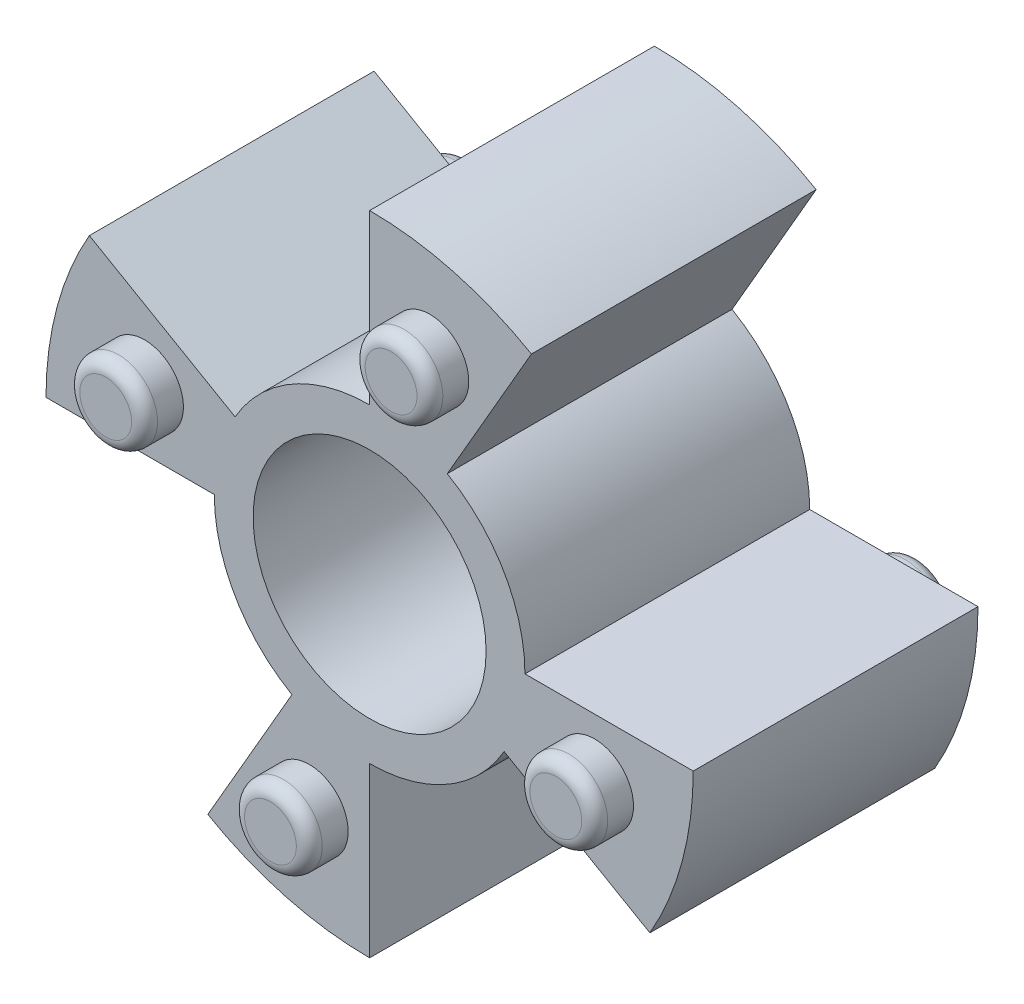
ISO-10303-21;
HEADER;
FILE_DESCRIPTION(('STEP AP214'),'2;1');
FILE_NAME('part.step','',(''),(''),'','','');
FILE_SCHEMA(('AUTOMOTIVE_DESIGN { 1 0 10303 214 1 1 1 1 }'));
ENDSEC;
DATA;
#1=APPLICATION_CONTEXT('core data for automotive mechanical design processes');
#2=APPLICATION_PROTOCOL_DEFINITION('international standard','automotive_design',2000,#1);
#3=PRODUCT_CONTEXT('',#1,'mechanical');
#4=PRODUCT('Part','Part','',(#3));
#5=PRODUCT_RELATED_PRODUCT_CATEGORY('part','',(#4));
#6=PRODUCT_DEFINITION_FORMATION('','',#4);
#7=PRODUCT_DEFINITION_CONTEXT('part definition',#1,'design');
#8=PRODUCT_DEFINITION('design','',#6,#7);
#9=PRODUCT_DEFINITION_SHAPE('','',#8);
#10=(LENGTH_UNIT() NAMED_UNIT(*) SI_UNIT(.MILLI.,.METRE.));
#11=(NAMED_UNIT(*) PLANE_ANGLE_UNIT() SI_UNIT($,.RADIAN.));
#12=(NAMED_UNIT(*) SI_UNIT($,.STERADIAN.) SOLID_ANGLE_UNIT());
#13=UNCERTAINTY_MEASURE_WITH_UNIT(LENGTH_MEASURE(1.E-05),#10,'distance_accuracy_value','');
#14=(GEOMETRIC_REPRESENTATION_CONTEXT(3) GLOBAL_UNCERTAINTY_ASSIGNED_CONTEXT((#13)) GLOBAL_UNIT_ASSIGNED_CONTEXT((#10,
#11,#12)) REPRESENTATION_CONTEXT('',''));
#15=CARTESIAN_POINT('',(0.,0.,0.));
#16=DIRECTION('',(0.,0.,1.));
#17=DIRECTION('',(1.,0.,0.));
#18=AXIS2_PLACEMENT_3D('',#15,#16,#17);
#19=CARTESIAN_POINT('',(0.,0.,5.5));
#20=DIRECTION('',(0.,0.,1.));
#21=DIRECTION('',(1.,0.,0.));
#22=AXIS2_PLACEMENT_3D('',#19,#20,#21);
#23=PLANE('',#22);
#24=CARTESIAN_POINT('',(-8.69333243660161,2.32937140592269,5.5));
#25=DIRECTION('',(0.,0.,1.));
#26=DIRECTION('',(-1.,0.,0.));
#27=AXIS2_PLACEMENT_3D('',#24,#25,#26);
#28=CIRCLE('',#27,1.5);
#29=CARTESIAN_POINT('',(-10.1933324366016,2.32937140592269,5.5));
#30=VERTEX_POINT('',#29);
#31=EDGE_CURVE('E293',#30,#30,#28,.T.);
#32=ORIENTED_EDGE('',*,*,#31,.F.);
#33=EDGE_LOOP('',(#32));
#34=FACE_BOUND('',#33,.T.);
#35=CARTESIAN_POINT('',(8.69333243660161,-2.32937140592269,5.5));
#36=DIRECTION('',(0.,0.,1.));
#37=DIRECTION('',(1.,0.,0.));
#38=AXIS2_PLACEMENT_3D('',#35,#36,#37);
#39=CIRCLE('',#38,1.5);
#40=CARTESIAN_POINT('',(10.1933324366016,-2.32937140592269,5.5));
#41=VERTEX_POINT('',#40);
#42=EDGE_CURVE('E304',#41,#41,#39,.T.);
#43=ORIENTED_EDGE('',*,*,#42,.F.);
#44=EDGE_LOOP('',(#43));
#45=FACE_BOUND('',#44,.T.);
#46=DIRECTION('',(-1.,0.,0.));
#47=VECTOR('',#46,1.);
#48=CARTESIAN_POINT('',(-12.5,1.30930550206618E-13,5.5));
#49=LINE('',#48,#47);
#50=CARTESIAN_POINT('',(-6.,0.,5.5));
#51=VERTEX_POINT('',#50);
#52=CARTESIAN_POINT('',(-12.5,1.30930550206618E-13,5.5));
#53=VERTEX_POINT('',#52);
#54=EDGE_CURVE('E156',#51,#53,#49,.T.);
#55=ORIENTED_EDGE('',*,*,#54,.F.);
#56=CARTESIAN_POINT('',(0.,0.,5.5));
#57=DIRECTION('',(0.,0.,-1.));
#58=DIRECTION('',(0.,-1.,0.));
#59=AXIS2_PLACEMENT_3D('',#56,#57,#58);
#60=CIRCLE('',#59,6.);
#61=CARTESIAN_POINT('',(-3.00000000000004,-5.19615242270661,5.5));
#62=VERTEX_POINT('',#61);
#63=EDGE_CURVE('E312',#62,#51,#60,.T.);
#64=ORIENTED_EDGE('',*,*,#63,.F.);
#65=DIRECTION('',(0.500000000000007,0.866025403784435,0.));
#66=VECTOR('',#65,1.);
#67=CARTESIAN_POINT('',(-6.25000000000008,-10.8253175473054,5.5));
#68=LINE('',#67,#66);
#69=CARTESIAN_POINT('',(-6.25000000000008,-10.8253175473054,5.5));
#70=VERTEX_POINT('',#69);
#71=EDGE_CURVE('E306',#70,#62,#68,.T.);
#72=ORIENTED_EDGE('',*,*,#71,.F.);
#73=CARTESIAN_POINT('',(0.,0.,5.5));
#74=DIRECTION('',(0.,0.,1.));
#75=DIRECTION('',(1.,0.,0.));
#76=AXIS2_PLACEMENT_3D('',#73,#74,#75);
#77=CIRCLE('',#76,12.5);
#78=CARTESIAN_POINT('',(0.,-12.5,5.5));
#79=VERTEX_POINT('',#78);
#80=EDGE_CURVE('E164',#70,#79,#77,.T.);
#81=ORIENTED_EDGE('',*,*,#80,.T.);
#82=DIRECTION('',(0.,-1.,0.));
#83=VECTOR('',#82,1.);
#84=CARTESIAN_POINT('',(0.,-12.5,5.5));
#85=LINE('',#84,#83);
#86=CARTESIAN_POINT('',(0.,-6.,5.5));
#87=VERTEX_POINT('',#86);
#88=EDGE_CURVE('E326',#87,#79,#85,.T.);
#89=ORIENTED_EDGE('',*,*,#88,.F.);
#90=CARTESIAN_POINT('',(0.,0.,5.5));
#91=DIRECTION('',(0.,0.,-1.));
#92=DIRECTION('',(1.,0.,0.));
#93=AXIS2_PLACEMENT_3D('',#90,#91,#92);
#94=CIRCLE('',#93,6.);
#95=CARTESIAN_POINT('',(5.19615242270664,-2.99999999999998,5.5));
#96=VERTEX_POINT('',#95);
#97=EDGE_CURVE('E332',#96,#87,#94,.T.);
#98=ORIENTED_EDGE('',*,*,#97,.F.);
#99=DIRECTION('',(-0.86602540378444,0.499999999999998,0.));
#100=VECTOR('',#99,1.);
#101=CARTESIAN_POINT('',(10.8253175473055,-6.24999999999997,5.5));
#102=LINE('',#101,#100);
#103=CARTESIAN_POINT('',(10.8253175473055,-6.24999999999997,5.5));
#104=VERTEX_POINT('',#103);
#105=EDGE_CURVE('E319',#104,#96,#102,.T.);
#106=ORIENTED_EDGE('',*,*,#105,.F.);
#107=CARTESIAN_POINT('',(12.5,0.,5.5));
#108=VERTEX_POINT('',#107);
#109=EDGE_CURVE('E405',#104,#108,#77,.T.);
#110=ORIENTED_EDGE('',*,*,#109,.T.);
#111=DIRECTION('',(1.,0.,0.));
#112=VECTOR('',#111,1.);
#113=CARTESIAN_POINT('',(12.5,0.,5.5));
#114=LINE('',#113,#112);
#115=CARTESIAN_POINT('',(6.,0.,5.5));
#116=VERTEX_POINT('',#115);
#117=EDGE_CURVE('E349',#116,#108,#114,.T.);
#118=ORIENTED_EDGE('',*,*,#117,.F.);
#119=CARTESIAN_POINT('',(0.,0.,5.5));
#120=DIRECTION('',(0.,0.,-1.));
#121=DIRECTION('',(0.,1.,0.));
#122=AXIS2_PLACEMENT_3D('',#119,#120,#121);
#123=CIRCLE('',#122,6.);
#124=CARTESIAN_POINT('',(3.,5.19615242270663,5.5));
#125=VERTEX_POINT('',#124);
#126=EDGE_CURVE('E358',#125,#116,#123,.T.);
#127=ORIENTED_EDGE('',*,*,#126,.F.);
#128=DIRECTION('',(-0.500000000000001,-0.866025403784438,0.));
#129=VECTOR('',#128,1.);
#130=CARTESIAN_POINT('',(6.25000000000001,10.8253175473055,5.5));
#131=LINE('',#130,#129);
#132=CARTESIAN_POINT('',(6.25000000000001,10.8253175473055,5.5));
#133=VERTEX_POINT('',#132);
#134=EDGE_CURVE('E339',#133,#125,#131,.T.);
#135=ORIENTED_EDGE('',*,*,#134,.F.);
#136=CARTESIAN_POINT('',(0.,12.5,5.5));
#137=VERTEX_POINT('',#136);
#138=EDGE_CURVE('E399',#133,#137,#77,.T.);
#139=ORIENTED_EDGE('',*,*,#138,.T.);
#140=DIRECTION('',(0.,1.,0.));
#141=VECTOR('',#140,1.);
#142=CARTESIAN_POINT('',(0.,12.5,5.5));
#143=LINE('',#142,#141);
#144=CARTESIAN_POINT('',(0.,6.,5.5));
#145=VERTEX_POINT('',#144);
#146=EDGE_CURVE('E376',#145,#137,#143,.T.);
#147=ORIENTED_EDGE('',*,*,#146,.F.);
#148=CARTESIAN_POINT('',(0.,0.,5.5));
#149=DIRECTION('',(0.,0.,-1.));
#150=DIRECTION('',(-1.,0.,0.));
#151=AXIS2_PLACEMENT_3D('',#148,#149,#150);
#152=CIRCLE('',#151,6.);
#153=CARTESIAN_POINT('',(-5.19615242270664,2.99999999999998,5.5));
#154=VERTEX_POINT('',#153);
#155=EDGE_CURVE('E385',#154,#145,#152,.T.);
#156=ORIENTED_EDGE('',*,*,#155,.F.);
#157=DIRECTION('',(0.86602540378444,-0.499999999999998,0.));
#158=VECTOR('',#157,1.);
#159=CARTESIAN_POINT('',(-10.8253175473055,6.24999999999997,5.5));
#160=LINE('',#159,#158);
#161=CARTESIAN_POINT('',(-10.8253175473055,6.24999999999997,5.5));
#162=VERTEX_POINT('',#161);
#163=EDGE_CURVE('E366',#162,#154,#160,.T.);
#164=ORIENTED_EDGE('',*,*,#163,.F.);
#165=EDGE_CURVE('E185',#162,#53,#77,.T.);
#166=ORIENTED_EDGE('',*,*,#165,.T.);
#167=EDGE_LOOP('',(#55,#64,#72,#81,#89,#98,#106,#110,#118,#127,#135,#139,#147,#156,#164,#166));
#168=FACE_BOUND('',#167,.T.);
#169=CARTESIAN_POINT('',(0.,0.,5.5));
#170=DIRECTION('',(0.,0.,1.));
#171=DIRECTION('',(1.,0.,0.));
#172=AXIS2_PLACEMENT_3D('',#169,#170,#171);
#173=CIRCLE('',#172,4.5);
#174=CARTESIAN_POINT('',(4.5,0.,5.5));
#175=VERTEX_POINT('',#174);
#176=EDGE_CURVE('E175',#175,#175,#173,.T.);
#177=ORIENTED_EDGE('',*,*,#176,.F.);
#178=EDGE_LOOP('',(#177));
#179=FACE_BOUND('',#178,.T.);
#180=CARTESIAN_POINT('',(-2.32937140592272,-8.6933324366016,5.5));
#181=DIRECTION('',(0.,0.,1.));
#182=DIRECTION('',(0.,-1.,0.));
#183=AXIS2_PLACEMENT_3D('',#180,#181,#182);
#184=CIRCLE('',#183,1.5);
#185=CARTESIAN_POINT('',(-2.32937140592273,-10.1933324366016,5.5));
#186=VERTEX_POINT('',#185);
#187=EDGE_CURVE('E298',#186,#186,#184,.T.);
#188=ORIENTED_EDGE('',*,*,#187,.F.);
#189=EDGE_LOOP('',(#188));
#190=FACE_BOUND('',#189,.T.);
#191=CARTESIAN_POINT('',(2.32937140592278,8.69333243660159,5.5));
#192=DIRECTION('',(0.,0.,1.));
#193=DIRECTION('',(0.,1.,0.));
#194=AXIS2_PLACEMENT_3D('',#191,#192,#193);
#195=CIRCLE('',#194,1.5);
#196=CARTESIAN_POINT('',(2.3293714059228,10.1933324366016,5.5));
#197=VERTEX_POINT('',#196);
#198=EDGE_CURVE('E290',#197,#197,#195,.T.);
#199=ORIENTED_EDGE('',*,*,#198,.F.);
#200=EDGE_LOOP('',(#199));
#201=FACE_BOUND('',#200,.T.);
#202=ADVANCED_FACE('F35',(#34,#45,#168,#179,#190,#201),#23,.T.);
#203=CARTESIAN_POINT('',(0.,0.,5.5));
#204=DIRECTION('',(0.,0.,-1.));
#205=DIRECTION('',(-1.,0.,0.));
#206=AXIS2_PLACEMENT_3D('',#203,#204,#205);
#207=CYLINDRICAL_SURFACE('',#206,12.5);
#208=CARTESIAN_POINT('',(0.,0.,-5.5));
#209=DIRECTION('',(0.,0.,1.));
#210=DIRECTION('',(1.,0.,0.));
#211=AXIS2_PLACEMENT_3D('',#208,#209,#210);
#212=CIRCLE('',#211,12.5);
#213=CARTESIAN_POINT('',(-10.8253175473055,6.24999999999997,-5.5));
#214=VERTEX_POINT('',#213);
#215=CARTESIAN_POINT('',(-12.5,1.30930550206618E-13,-5.5));
#216=VERTEX_POINT('',#215);
#217=EDGE_CURVE('E171',#214,#216,#212,.T.);
#218=ORIENTED_EDGE('',*,*,#217,.T.);
#219=DIRECTION('',(0.,0.,1.));
#220=VECTOR('',#219,1.);
#221=CARTESIAN_POINT('',(-12.5,1.30930550206618E-13,-5.5));
#222=LINE('',#221,#220);
#223=EDGE_CURVE('E316',#216,#53,#222,.T.);
#224=ORIENTED_EDGE('',*,*,#223,.T.);
#225=ORIENTED_EDGE('',*,*,#165,.F.);
#226=DIRECTION('',(0.,0.,1.));
#227=VECTOR('',#226,1.);
#228=CARTESIAN_POINT('',(-10.8253175473055,6.24999999999997,-5.5));
#229=LINE('',#228,#227);
#230=EDGE_CURVE('E382',#214,#162,#229,.T.);
#231=ORIENTED_EDGE('',*,*,#230,.F.);
#232=EDGE_LOOP('',(#218,#224,#225,#231));
#233=FACE_BOUND('',#232,.T.);
#234=ADVANCED_FACE('F225',(#233),#207,.T.);
#235=ORIENTED_EDGE('',*,*,#80,.F.);
#236=DIRECTION('',(0.,0.,1.));
#237=VECTOR('',#236,1.);
#238=CARTESIAN_POINT('',(-6.25000000000008,-10.8253175473054,-5.5));
#239=LINE('',#238,#237);
#240=CARTESIAN_POINT('',(-6.25000000000008,-10.8253175473054,-5.5));
#241=VERTEX_POINT('',#240);
#242=EDGE_CURVE('E151',#241,#70,#239,.T.);
#243=ORIENTED_EDGE('',*,*,#242,.F.);
#244=CARTESIAN_POINT('',(0.,-12.5,-5.5));
#245=VERTEX_POINT('',#244);
#246=EDGE_CURVE('E162',#241,#245,#212,.T.);
#247=ORIENTED_EDGE('',*,*,#246,.T.);
#248=DIRECTION('',(0.,0.,1.));
#249=VECTOR('',#248,1.);
#250=CARTESIAN_POINT('',(0.,-12.5,-5.5));
#251=LINE('',#250,#249);
#252=EDGE_CURVE('E337',#245,#79,#251,.T.);
#253=ORIENTED_EDGE('',*,*,#252,.T.);
#254=EDGE_LOOP('',(#235,#243,#247,#253));
#255=FACE_BOUND('',#254,.T.);
#256=ADVANCED_FACE('F160',(#255),#207,.T.);
#257=ORIENTED_EDGE('',*,*,#109,.F.);
#258=DIRECTION('',(0.,0.,1.));
#259=VECTOR('',#258,1.);
#260=CARTESIAN_POINT('',(10.8253175473055,-6.24999999999997,-5.5));
#261=LINE('',#260,#259);
#262=CARTESIAN_POINT('',(10.8253175473055,-6.24999999999997,-5.5));
#263=VERTEX_POINT('',#262);
#264=EDGE_CURVE('E329',#263,#104,#261,.T.);
#265=ORIENTED_EDGE('',*,*,#264,.F.);
#266=CARTESIAN_POINT('',(12.5,0.,-5.5));
#267=VERTEX_POINT('',#266);
#268=EDGE_CURVE('E172',#263,#267,#212,.T.);
#269=ORIENTED_EDGE('',*,*,#268,.T.);
#270=DIRECTION('',(0.,0.,1.));
#271=VECTOR('',#270,1.);
#272=CARTESIAN_POINT('',(12.5,0.,-5.5));
#273=LINE('',#272,#271);
#274=EDGE_CURVE('E363',#267,#108,#273,.T.);
#275=ORIENTED_EDGE('',*,*,#274,.T.);
#276=EDGE_LOOP('',(#257,#265,#269,#275));
#277=FACE_BOUND('',#276,.T.);
#278=ADVANCED_FACE('F247',(#277),#207,.T.);
#279=CARTESIAN_POINT('',(0.,0.,5.5));
#280=DIRECTION('',(0.,0.,-1.));
#281=DIRECTION('',(-1.,0.,0.));
#282=AXIS2_PLACEMENT_3D('',#279,#280,#281);
#283=CYLINDRICAL_SURFACE('',#282,4.5);
#284=ORIENTED_EDGE('',*,*,#176,.T.);
#285=EDGE_LOOP('',(#284));
#286=FACE_BOUND('',#285,.T.);
#287=CARTESIAN_POINT('',(0.,0.,-5.5));
#288=DIRECTION('',(0.,0.,1.));
#289=DIRECTION('',(1.,0.,0.));
#290=AXIS2_PLACEMENT_3D('',#287,#288,#289);
#291=CIRCLE('',#290,4.5);
#292=CARTESIAN_POINT('',(4.5,0.,-5.5));
#293=VERTEX_POINT('',#292);
#294=EDGE_CURVE('E179',#293,#293,#291,.T.);
#295=ORIENTED_EDGE('',*,*,#294,.F.);
#296=EDGE_LOOP('',(#295));
#297=FACE_BOUND('',#296,.T.);
#298=ADVANCED_FACE('F245',(#286,#297),#283,.F.);
#299=ORIENTED_EDGE('',*,*,#138,.F.);
#300=DIRECTION('',(0.,0.,1.));
#301=VECTOR('',#300,1.);
#302=CARTESIAN_POINT('',(6.25000000000001,10.8253175473055,-5.5));
#303=LINE('',#302,#301);
#304=CARTESIAN_POINT('',(6.25000000000001,10.8253175473055,-5.5));
#305=VERTEX_POINT('',#304);
#306=EDGE_CURVE('E355',#305,#133,#303,.T.);
#307=ORIENTED_EDGE('',*,*,#306,.F.);
#308=CARTESIAN_POINT('',(0.,12.5,-5.5));
#309=VERTEX_POINT('',#308);
#310=EDGE_CURVE('E176',#305,#309,#212,.T.);
#311=ORIENTED_EDGE('',*,*,#310,.T.);
#312=DIRECTION('',(0.,0.,1.));
#313=VECTOR('',#312,1.);
#314=CARTESIAN_POINT('',(0.,12.5,-5.5));
#315=LINE('',#314,#313);
#316=EDGE_CURVE('E390',#309,#137,#315,.T.);
#317=ORIENTED_EDGE('',*,*,#316,.T.);
#318=EDGE_LOOP('',(#299,#307,#311,#317));
#319=FACE_BOUND('',#318,.T.);
#320=ADVANCED_FACE('F233',(#319),#207,.T.);
#321=CARTESIAN_POINT('',(0.,0.,-5.5));
#322=DIRECTION('',(0.,0.,1.));
#323=DIRECTION('',(1.,0.,0.));
#324=AXIS2_PLACEMENT_3D('',#321,#322,#323);
#325=PLANE('',#324);
#326=CARTESIAN_POINT('',(-8.69333243660161,2.32937140592269,-5.5));
#327=DIRECTION('',(0.,0.,1.));
#328=DIRECTION('',(-1.,0.,0.));
#329=AXIS2_PLACEMENT_3D('',#326,#327,#328);
#330=CIRCLE('',#329,1.5);
#331=CARTESIAN_POINT('',(-10.1933324366016,2.32937140592269,-5.5));
#332=VERTEX_POINT('',#331);
#333=EDGE_CURVE('E289',#332,#332,#330,.T.);
#334=ORIENTED_EDGE('',*,*,#333,.T.);
#335=EDGE_LOOP('',(#334));
#336=FACE_BOUND('',#335,.T.);
#337=CARTESIAN_POINT('',(8.69333243660161,-2.32937140592269,-5.5));
#338=DIRECTION('',(0.,0.,1.));
#339=DIRECTION('',(1.,0.,0.));
#340=AXIS2_PLACEMENT_3D('',#337,#338,#339);
#341=CIRCLE('',#340,1.5);
#342=CARTESIAN_POINT('',(10.1933324366016,-2.32937140592269,-5.5));
#343=VERTEX_POINT('',#342);
#344=EDGE_CURVE('E301',#343,#343,#341,.T.);
#345=ORIENTED_EDGE('',*,*,#344,.T.);
#346=EDGE_LOOP('',(#345));
#347=FACE_BOUND('',#346,.T.);
#348=ORIENTED_EDGE('',*,*,#294,.T.);
#349=EDGE_LOOP('',(#348));
#350=FACE_BOUND('',#349,.T.);
#351=CARTESIAN_POINT('',(0.,0.,-5.5));
#352=DIRECTION('',(0.,0.,-1.));
#353=DIRECTION('',(0.,-1.,0.));
#354=AXIS2_PLACEMENT_3D('',#351,#352,#353);
#355=CIRCLE('',#354,6.);
#356=CARTESIAN_POINT('',(-3.00000000000004,-5.19615242270661,-5.5));
#357=VERTEX_POINT('',#356);
#358=CARTESIAN_POINT('',(-6.,0.,-5.5));
#359=VERTEX_POINT('',#358);
#360=EDGE_CURVE('E50',#357,#359,#355,.T.);
#361=ORIENTED_EDGE('',*,*,#360,.T.);
#362=DIRECTION('',(-1.,0.,0.));
#363=VECTOR('',#362,1.);
#364=CARTESIAN_POINT('',(-12.5,1.30930550206618E-13,-5.5));
#365=LINE('',#364,#363);
#366=EDGE_CURVE('E165',#359,#216,#365,.T.);
#367=ORIENTED_EDGE('',*,*,#366,.T.);
#368=ORIENTED_EDGE('',*,*,#217,.F.);
#369=DIRECTION('',(0.86602540378444,-0.499999999999998,0.));
#370=VECTOR('',#369,1.);
#371=CARTESIAN_POINT('',(-10.8253175473055,6.24999999999997,-5.5));
#372=LINE('',#371,#370);
#373=CARTESIAN_POINT('',(-5.19615242270664,2.99999999999999,-5.5));
#374=VERTEX_POINT('',#373);
#375=EDGE_CURVE('E372',#214,#374,#372,.T.);
#376=ORIENTED_EDGE('',*,*,#375,.T.);
#377=CARTESIAN_POINT('',(0.,0.,-5.5));
#378=DIRECTION('',(0.,0.,-1.));
#379=DIRECTION('',(-1.,0.,0.));
#380=AXIS2_PLACEMENT_3D('',#377,#378,#379);
#381=CIRCLE('',#380,6.);
#382=CARTESIAN_POINT('',(0.,6.,-5.5));
#383=VERTEX_POINT('',#382);
#384=EDGE_CURVE('E375',#374,#383,#381,.T.);
#385=ORIENTED_EDGE('',*,*,#384,.T.);
#386=DIRECTION('',(0.,1.,0.));
#387=VECTOR('',#386,1.);
#388=CARTESIAN_POINT('',(0.,12.5,-5.5));
#389=LINE('',#388,#387);
#390=EDGE_CURVE('E379',#383,#309,#389,.T.);
#391=ORIENTED_EDGE('',*,*,#390,.T.);
#392=ORIENTED_EDGE('',*,*,#310,.F.);
#393=DIRECTION('',(-0.500000000000001,-0.866025403784438,0.));
#394=VECTOR('',#393,1.);
#395=CARTESIAN_POINT('',(6.25000000000001,10.8253175473055,-5.5));
#396=LINE('',#395,#394);
#397=CARTESIAN_POINT('',(3.,5.19615242270663,-5.5));
#398=VERTEX_POINT('',#397);
#399=EDGE_CURVE('E345',#305,#398,#396,.T.);
#400=ORIENTED_EDGE('',*,*,#399,.T.);
#401=CARTESIAN_POINT('',(0.,0.,-5.5));
#402=DIRECTION('',(0.,0.,-1.));
#403=DIRECTION('',(0.,1.,0.));
#404=AXIS2_PLACEMENT_3D('',#401,#402,#403);
#405=CIRCLE('',#404,6.);
#406=CARTESIAN_POINT('',(6.,0.,-5.5));
#407=VERTEX_POINT('',#406);
#408=EDGE_CURVE('E348',#398,#407,#405,.T.);
#409=ORIENTED_EDGE('',*,*,#408,.T.);
#410=DIRECTION('',(1.,0.,0.));
#411=VECTOR('',#410,1.);
#412=CARTESIAN_POINT('',(12.5,0.,-5.5));
#413=LINE('',#412,#411);
#414=EDGE_CURVE('E352',#407,#267,#413,.T.);
#415=ORIENTED_EDGE('',*,*,#414,.T.);
#416=ORIENTED_EDGE('',*,*,#268,.F.);
#417=DIRECTION('',(-0.86602540378444,0.499999999999998,0.));
#418=VECTOR('',#417,1.);
#419=CARTESIAN_POINT('',(10.8253175473055,-6.24999999999997,-5.5));
#420=LINE('',#419,#418);
#421=CARTESIAN_POINT('',(5.19615242270664,-2.99999999999999,-5.5));
#422=VERTEX_POINT('',#421);
#423=EDGE_CURVE('E323',#263,#422,#420,.T.);
#424=ORIENTED_EDGE('',*,*,#423,.T.);
#425=CARTESIAN_POINT('',(0.,0.,-5.5));
#426=DIRECTION('',(0.,0.,-1.));
#427=DIRECTION('',(1.,0.,0.));
#428=AXIS2_PLACEMENT_3D('',#425,#426,#427);
#429=CIRCLE('',#428,6.);
#430=CARTESIAN_POINT('',(0.,-6.,-5.5));
#431=VERTEX_POINT('',#430);
#432=EDGE_CURVE('E58',#422,#431,#429,.T.);
#433=ORIENTED_EDGE('',*,*,#432,.T.);
#434=DIRECTION('',(0.,-1.,0.));
#435=VECTOR('',#434,1.);
#436=CARTESIAN_POINT('',(0.,-12.5,-5.5));
#437=LINE('',#436,#435);
#438=EDGE_CURVE('E170',#431,#245,#437,.T.);
#439=ORIENTED_EDGE('',*,*,#438,.T.);
#440=ORIENTED_EDGE('',*,*,#246,.F.);
#441=DIRECTION('',(0.500000000000007,0.866025403784435,0.));
#442=VECTOR('',#441,1.);
#443=CARTESIAN_POINT('',(-6.25000000000008,-10.8253175473054,-5.5));
#444=LINE('',#443,#442);
#445=EDGE_CURVE('E147',#241,#357,#444,.T.);
#446=ORIENTED_EDGE('',*,*,#445,.T.);
#447=EDGE_LOOP('',(#361,#367,#368,#376,#385,#391,#392,#400,#409,#415,#416,#424,#433,#439,#440,#446));
#448=FACE_BOUND('',#447,.T.);
#449=ADVANCED_FACE('F168',(#336,#347,#350,#448),#325,.F.);
#450=CARTESIAN_POINT('',(0.,12.5,-5.5));
#451=DIRECTION('',(1.,0.,0.));
#452=DIRECTION('',(0.,1.,0.));
#453=AXIS2_PLACEMENT_3D('',#450,#451,#452);
#454=PLANE('',#453);
#455=ORIENTED_EDGE('',*,*,#146,.T.);
#456=ORIENTED_EDGE('',*,*,#316,.F.);
#457=ORIENTED_EDGE('',*,*,#390,.F.);
#458=DIRECTION('',(0.,0.,1.));
#459=VECTOR('',#458,1.);
#460=CARTESIAN_POINT('',(0.,6.,-5.5));
#461=LINE('',#460,#459);
#462=EDGE_CURVE('E393',#383,#145,#461,.T.);
#463=ORIENTED_EDGE('',*,*,#462,.T.);
#464=EDGE_LOOP('',(#455,#456,#457,#463));
#465=FACE_BOUND('',#464,.T.);
#466=ADVANCED_FACE('F241',(#465),#454,.F.);
#467=CARTESIAN_POINT('',(0.,0.,-5.5));
#468=DIRECTION('',(0.,0.,1.));
#469=DIRECTION('',(1.,0.,0.));
#470=AXIS2_PLACEMENT_3D('',#467,#468,#469);
#471=CYLINDRICAL_SURFACE('',#470,6.);
#472=ORIENTED_EDGE('',*,*,#155,.T.);
#473=ORIENTED_EDGE('',*,*,#462,.F.);
#474=ORIENTED_EDGE('',*,*,#384,.F.);
#475=DIRECTION('',(0.,0.,1.));
#476=VECTOR('',#475,1.);
#477=CARTESIAN_POINT('',(-5.19615242270664,2.99999999999998,-5.5));
#478=LINE('',#477,#476);
#479=EDGE_CURVE('E395',#374,#154,#478,.T.);
#480=ORIENTED_EDGE('',*,*,#479,.T.);
#481=EDGE_LOOP('',(#472,#473,#474,#480));
#482=FACE_BOUND('',#481,.T.);
#483=ADVANCED_FACE('F435',(#482),#471,.T.);
#484=CARTESIAN_POINT('',(-10.8253175473055,6.24999999999997,-5.5));
#485=DIRECTION('',(-0.499999999999998,-0.86602540378444,0.));
#486=DIRECTION('',(0.86602540378444,-0.499999999999998,0.));
#487=AXIS2_PLACEMENT_3D('',#484,#485,#486);
#488=PLANE('',#487);
#489=ORIENTED_EDGE('',*,*,#163,.T.);
#490=ORIENTED_EDGE('',*,*,#479,.F.);
#491=ORIENTED_EDGE('',*,*,#375,.F.);
#492=ORIENTED_EDGE('',*,*,#230,.T.);
#493=EDGE_LOOP('',(#489,#490,#491,#492));
#494=FACE_BOUND('',#493,.T.);
#495=ADVANCED_FACE('F238',(#494),#488,.F.);
#496=CARTESIAN_POINT('',(12.5,0.,-5.5));
#497=DIRECTION('',(0.,-1.,0.));
#498=DIRECTION('',(1.,0.,0.));
#499=AXIS2_PLACEMENT_3D('',#496,#497,#498);
#500=PLANE('',#499);
#501=ORIENTED_EDGE('',*,*,#117,.T.);
#502=ORIENTED_EDGE('',*,*,#274,.F.);
#503=ORIENTED_EDGE('',*,*,#414,.F.);
#504=DIRECTION('',(0.,0.,1.));
#505=VECTOR('',#504,1.);
#506=CARTESIAN_POINT('',(6.,0.,-5.5));
#507=LINE('',#506,#505);
#508=EDGE_CURVE('E367',#407,#116,#507,.T.);
#509=ORIENTED_EDGE('',*,*,#508,.T.);
#510=EDGE_LOOP('',(#501,#502,#503,#509));
#511=FACE_BOUND('',#510,.T.);
#512=ADVANCED_FACE('F419',(#511),#500,.F.);
#513=CARTESIAN_POINT('',(0.,0.,-5.5));
#514=DIRECTION('',(0.,0.,1.));
#515=DIRECTION('',(1.,0.,0.));
#516=AXIS2_PLACEMENT_3D('',#513,#514,#515);
#517=CYLINDRICAL_SURFACE('',#516,6.);
#518=ORIENTED_EDGE('',*,*,#126,.T.);
#519=ORIENTED_EDGE('',*,*,#508,.F.);
#520=ORIENTED_EDGE('',*,*,#408,.F.);
#521=DIRECTION('',(0.,0.,1.));
#522=VECTOR('',#521,1.);
#523=CARTESIAN_POINT('',(3.,5.19615242270663,-5.5));
#524=LINE('',#523,#522);
#525=EDGE_CURVE('E369',#398,#125,#524,.T.);
#526=ORIENTED_EDGE('',*,*,#525,.T.);
#527=EDGE_LOOP('',(#518,#519,#520,#526));
#528=FACE_BOUND('',#527,.T.);
#529=ADVANCED_FACE('F425',(#528),#517,.T.);
#530=CARTESIAN_POINT('',(6.25000000000001,10.8253175473055,-5.5));
#531=DIRECTION('',(-0.866025403784438,0.500000000000001,0.));
#532=DIRECTION('',(-0.500000000000001,-0.866025403784438,0.));
#533=AXIS2_PLACEMENT_3D('',#530,#531,#532);
#534=PLANE('',#533);
#535=ORIENTED_EDGE('',*,*,#134,.T.);
#536=ORIENTED_EDGE('',*,*,#525,.F.);
#537=ORIENTED_EDGE('',*,*,#399,.F.);
#538=ORIENTED_EDGE('',*,*,#306,.T.);
#539=EDGE_LOOP('',(#535,#536,#537,#538));
#540=FACE_BOUND('',#539,.T.);
#541=ADVANCED_FACE('F427',(#540),#534,.F.);
#542=CARTESIAN_POINT('',(0.,-12.5,-5.5));
#543=DIRECTION('',(-1.,0.,0.));
#544=DIRECTION('',(0.,-1.,0.));
#545=AXIS2_PLACEMENT_3D('',#542,#543,#544);
#546=PLANE('',#545);
#547=ORIENTED_EDGE('',*,*,#88,.T.);
#548=ORIENTED_EDGE('',*,*,#252,.F.);
#549=ORIENTED_EDGE('',*,*,#438,.F.);
#550=DIRECTION('',(0.,0.,1.));
#551=VECTOR('',#550,1.);
#552=CARTESIAN_POINT('',(0.,-6.,-5.5));
#553=LINE('',#552,#551);
#554=EDGE_CURVE('E340',#431,#87,#553,.T.);
#555=ORIENTED_EDGE('',*,*,#554,.T.);
#556=EDGE_LOOP('',(#547,#548,#549,#555));
#557=FACE_BOUND('',#556,.T.);
#558=ADVANCED_FACE('F456',(#557),#546,.F.);
#559=CARTESIAN_POINT('',(0.,0.,-5.5));
#560=DIRECTION('',(0.,0.,1.));
#561=DIRECTION('',(1.,0.,0.));
#562=AXIS2_PLACEMENT_3D('',#559,#560,#561);
#563=CYLINDRICAL_SURFACE('',#562,6.);
#564=ORIENTED_EDGE('',*,*,#97,.T.);
#565=ORIENTED_EDGE('',*,*,#554,.F.);
#566=ORIENTED_EDGE('',*,*,#432,.F.);
#567=DIRECTION('',(0.,0.,1.));
#568=VECTOR('',#567,1.);
#569=CARTESIAN_POINT('',(5.19615242270664,-2.99999999999998,-5.5));
#570=LINE('',#569,#568);
#571=EDGE_CURVE('E342',#422,#96,#570,.T.);
#572=ORIENTED_EDGE('',*,*,#571,.T.);
#573=EDGE_LOOP('',(#564,#565,#566,#572));
#574=FACE_BOUND('',#573,.T.);
#575=ADVANCED_FACE('F459',(#574),#563,.T.);
#576=CARTESIAN_POINT('',(10.8253175473055,-6.24999999999997,-5.5));
#577=DIRECTION('',(0.499999999999998,0.86602540378444,0.));
#578=DIRECTION('',(-0.86602540378444,0.499999999999998,0.));
#579=AXIS2_PLACEMENT_3D('',#576,#577,#578);
#580=PLANE('',#579);
#581=ORIENTED_EDGE('',*,*,#105,.T.);
#582=ORIENTED_EDGE('',*,*,#571,.F.);
#583=ORIENTED_EDGE('',*,*,#423,.F.);
#584=ORIENTED_EDGE('',*,*,#264,.T.);
#585=EDGE_LOOP('',(#581,#582,#583,#584));
#586=FACE_BOUND('',#585,.T.);
#587=ADVANCED_FACE('F452',(#586),#580,.F.);
#588=CARTESIAN_POINT('',(-12.5,1.30930550206618E-13,-5.5));
#589=DIRECTION('',(0.,1.,0.));
#590=DIRECTION('',(-1.,0.,0.));
#591=AXIS2_PLACEMENT_3D('',#588,#589,#590);
#592=PLANE('',#591);
#593=ORIENTED_EDGE('',*,*,#54,.T.);
#594=ORIENTED_EDGE('',*,*,#223,.F.);
#595=ORIENTED_EDGE('',*,*,#366,.F.);
#596=DIRECTION('',(0.,0.,1.));
#597=VECTOR('',#596,1.);
#598=CARTESIAN_POINT('',(-6.,0.,-5.5));
#599=LINE('',#598,#597);
#600=EDGE_CURVE('E320',#359,#51,#599,.T.);
#601=ORIENTED_EDGE('',*,*,#600,.T.);
#602=EDGE_LOOP('',(#593,#594,#595,#601));
#603=FACE_BOUND('',#602,.T.);
#604=ADVANCED_FACE('F441',(#603),#592,.F.);
#605=CARTESIAN_POINT('',(0.,0.,-5.5));
#606=DIRECTION('',(0.,0.,1.));
#607=DIRECTION('',(1.,0.,0.));
#608=AXIS2_PLACEMENT_3D('',#605,#606,#607);
#609=CYLINDRICAL_SURFACE('',#608,6.);
#610=ORIENTED_EDGE('',*,*,#63,.T.);
#611=ORIENTED_EDGE('',*,*,#600,.F.);
#612=ORIENTED_EDGE('',*,*,#360,.F.);
#613=DIRECTION('',(0.,0.,1.));
#614=VECTOR('',#613,1.);
#615=CARTESIAN_POINT('',(-3.00000000000004,-5.19615242270661,-5.5));
#616=LINE('',#615,#614);
#617=EDGE_CURVE('E153',#357,#62,#616,.T.);
#618=ORIENTED_EDGE('',*,*,#617,.T.);
#619=EDGE_LOOP('',(#610,#611,#612,#618));
#620=FACE_BOUND('',#619,.T.);
#621=ADVANCED_FACE('F443',(#620),#609,.T.);
#622=CARTESIAN_POINT('',(-6.25000000000008,-10.8253175473054,-5.5));
#623=DIRECTION('',(0.866025403784435,-0.500000000000007,0.));
#624=DIRECTION('',(0.500000000000007,0.866025403784435,0.));
#625=AXIS2_PLACEMENT_3D('',#622,#623,#624);
#626=PLANE('',#625);
#627=ORIENTED_EDGE('',*,*,#71,.T.);
#628=ORIENTED_EDGE('',*,*,#617,.F.);
#629=ORIENTED_EDGE('',*,*,#445,.F.);
#630=ORIENTED_EDGE('',*,*,#242,.T.);
#631=EDGE_LOOP('',(#627,#628,#629,#630));
#632=FACE_BOUND('',#631,.T.);
#633=ADVANCED_FACE('F150',(#632),#626,.F.);
#634=CARTESIAN_POINT('',(8.69333243660161,-2.32937140592269,7.));
#635=DIRECTION('',(0.,0.,-1.));
#636=DIRECTION('',(-1.,0.,0.));
#637=AXIS2_PLACEMENT_3D('',#634,#635,#636);
#638=CYLINDRICAL_SURFACE('',#637,1.5);
#639=CARTESIAN_POINT('',(8.69333243660161,-2.32937140592269,6.5));
#640=DIRECTION('',(0.,0.,1.));
#641=DIRECTION('',(1.,0.,0.));
#642=AXIS2_PLACEMENT_3D('',#639,#640,#641);
#643=CIRCLE('',#642,1.5);
#644=CARTESIAN_POINT('',(10.1933324366016,-2.32937140592269,6.5));
#645=VERTEX_POINT('',#644);
#646=EDGE_CURVE('E184',#645,#645,#643,.F.);
#647=ORIENTED_EDGE('',*,*,#646,.T.);
#648=EDGE_LOOP('',(#647));
#649=FACE_BOUND('',#648,.T.);
#650=ORIENTED_EDGE('',*,*,#42,.T.);
#651=EDGE_LOOP('',(#650));
#652=FACE_BOUND('',#651,.T.);
#653=ADVANCED_FACE('F450',(#649,#652),#638,.T.);
#654=CARTESIAN_POINT('',(8.69333243660161,-2.32937140592269,7.));
#655=DIRECTION('',(0.,0.,1.));
#656=DIRECTION('',(1.,0.,0.));
#657=AXIS2_PLACEMENT_3D('',#654,#655,#656);
#658=PLANE('',#657);
#659=CARTESIAN_POINT('',(8.69333243660161,-2.32937140592269,7.));
#660=DIRECTION('',(0.,0.,1.));
#661=DIRECTION('',(1.,0.,0.));
#662=AXIS2_PLACEMENT_3D('',#659,#660,#661);
#663=CIRCLE('',#662,0.999999999999999);
#664=CARTESIAN_POINT('',(9.69333243660161,-2.32937140592269,7.));
#665=VERTEX_POINT('',#664);
#666=EDGE_CURVE('E181',#665,#665,#663,.T.);
#667=ORIENTED_EDGE('',*,*,#666,.T.);
#668=EDGE_LOOP('',(#667));
#669=FACE_BOUND('',#668,.T.);
#670=ADVANCED_FACE('F255',(#669),#658,.T.);
#671=CARTESIAN_POINT('',(8.69333243660161,-2.32937140592269,6.5));
#672=DIRECTION('',(0.,0.,1.));
#673=DIRECTION('',(1.,0.,0.));
#674=AXIS2_PLACEMENT_3D('',#671,#672,#673);
#675=TOROIDAL_SURFACE('',#674,0.999999999999999,0.5);
#676=ORIENTED_EDGE('',*,*,#646,.F.);
#677=EDGE_LOOP('',(#676));
#678=FACE_BOUND('',#677,.T.);
#679=ORIENTED_EDGE('',*,*,#666,.F.);
#680=EDGE_LOOP('',(#679));
#681=FACE_BOUND('',#680,.T.);
#682=ADVANCED_FACE('F251',(#678,#681),#675,.T.);
#683=CARTESIAN_POINT('',(8.69333243660161,-2.32937140592269,-7.));
#684=DIRECTION('',(0.,0.,1.));
#685=DIRECTION('',(1.,0.,0.));
#686=AXIS2_PLACEMENT_3D('',#683,#684,#685);
#687=CYLINDRICAL_SURFACE('',#686,1.5);
#688=CARTESIAN_POINT('',(8.69333243660161,-2.32937140592269,-6.5));
#689=DIRECTION('',(0.,0.,-1.));
#690=DIRECTION('',(-1.,0.,0.));
#691=AXIS2_PLACEMENT_3D('',#688,#689,#690);
#692=CIRCLE('',#691,1.5);
#693=CARTESIAN_POINT('',(7.19333243660161,-2.32937140592269,-6.5));
#694=VERTEX_POINT('',#693);
#695=EDGE_CURVE('E188',#694,#694,#692,.F.);
#696=ORIENTED_EDGE('',*,*,#695,.T.);
#697=EDGE_LOOP('',(#696));
#698=FACE_BOUND('',#697,.T.);
#699=ORIENTED_EDGE('',*,*,#344,.F.);
#700=EDGE_LOOP('',(#699));
#701=FACE_BOUND('',#700,.T.);
#702=ADVANCED_FACE('F254',(#698,#701),#687,.T.);
#703=CARTESIAN_POINT('',(8.69333243660161,-2.32937140592269,-7.));
#704=DIRECTION('',(0.,0.,-1.));
#705=DIRECTION('',(1.,0.,0.));
#706=AXIS2_PLACEMENT_3D('',#703,#704,#705);
#707=PLANE('',#706);
#708=CARTESIAN_POINT('',(8.69333243660161,-2.32937140592269,-7.));
#709=DIRECTION('',(0.,0.,-1.));
#710=DIRECTION('',(-1.,0.,0.));
#711=AXIS2_PLACEMENT_3D('',#708,#709,#710);
#712=CIRCLE('',#711,0.999999999999999);
#713=CARTESIAN_POINT('',(7.69333243660161,-2.32937140592269,-7.));
#714=VERTEX_POINT('',#713);
#715=EDGE_CURVE('E191',#714,#714,#712,.T.);
#716=ORIENTED_EDGE('',*,*,#715,.T.);
#717=EDGE_LOOP('',(#716));
#718=FACE_BOUND('',#717,.T.);
#719=ADVANCED_FACE('F261',(#718),#707,.T.);
#720=CARTESIAN_POINT('',(8.69333243660161,-2.32937140592269,-6.5));
#721=DIRECTION('',(0.,0.,-1.));
#722=DIRECTION('',(-1.,0.,0.));
#723=AXIS2_PLACEMENT_3D('',#720,#721,#722);
#724=TOROIDAL_SURFACE('',#723,0.999999999999999,0.5);
#725=ORIENTED_EDGE('',*,*,#715,.F.);
#726=EDGE_LOOP('',(#725));
#727=FACE_BOUND('',#726,.T.);
#728=ORIENTED_EDGE('',*,*,#695,.F.);
#729=EDGE_LOOP('',(#728));
#730=FACE_BOUND('',#729,.T.);
#731=ADVANCED_FACE('F257',(#727,#730),#724,.T.);
#732=CARTESIAN_POINT('',(-2.32937140592272,-8.6933324366016,7.));
#733=DIRECTION('',(0.,0.,-1.));
#734=DIRECTION('',(-1.,0.,0.));
#735=AXIS2_PLACEMENT_3D('',#732,#733,#734);
#736=CYLINDRICAL_SURFACE('',#735,1.5);
#737=CARTESIAN_POINT('',(-2.32937140592272,-8.6933324366016,6.5));
#738=DIRECTION('',(0.,0.,1.));
#739=DIRECTION('',(1.,0.,0.));
#740=AXIS2_PLACEMENT_3D('',#737,#738,#739);
#741=CIRCLE('',#740,1.5);
#742=CARTESIAN_POINT('',(-0.829371405922721,-8.6933324366016,6.5));
#743=VERTEX_POINT('',#742);
#744=EDGE_CURVE('E197',#743,#743,#741,.F.);
#745=ORIENTED_EDGE('',*,*,#744,.T.);
#746=EDGE_LOOP('',(#745));
#747=FACE_BOUND('',#746,.T.);
#748=ORIENTED_EDGE('',*,*,#187,.T.);
#749=EDGE_LOOP('',(#748));
#750=FACE_BOUND('',#749,.T.);
#751=ADVANCED_FACE('F260',(#747,#750),#736,.T.);
#752=CARTESIAN_POINT('',(-2.32937140592272,-8.6933324366016,7.));
#753=DIRECTION('',(0.,0.,1.));
#754=DIRECTION('',(0.,-1.,0.));
#755=AXIS2_PLACEMENT_3D('',#752,#753,#754);
#756=PLANE('',#755);
#757=CARTESIAN_POINT('',(-2.32937140592272,-8.6933324366016,7.));
#758=DIRECTION('',(0.,0.,1.));
#759=DIRECTION('',(1.,0.,0.));
#760=AXIS2_PLACEMENT_3D('',#757,#758,#759);
#761=CIRCLE('',#760,0.999999999999999);
#762=CARTESIAN_POINT('',(-1.32937140592272,-8.6933324366016,7.));
#763=VERTEX_POINT('',#762);
#764=EDGE_CURVE('E194',#763,#763,#761,.T.);
#765=ORIENTED_EDGE('',*,*,#764,.T.);
#766=EDGE_LOOP('',(#765));
#767=FACE_BOUND('',#766,.T.);
#768=ADVANCED_FACE('F579',(#767),#756,.T.);
#769=CARTESIAN_POINT('',(-8.69333243660161,2.32937140592269,7.));
#770=DIRECTION('',(0.,0.,-1.));
#771=DIRECTION('',(-1.,0.,0.));
#772=AXIS2_PLACEMENT_3D('',#769,#770,#771);
#773=CYLINDRICAL_SURFACE('',#772,1.5);
#774=CARTESIAN_POINT('',(-8.69333243660161,2.32937140592269,6.5));
#775=DIRECTION('',(0.,0.,1.));
#776=DIRECTION('',(1.,0.,0.));
#777=AXIS2_PLACEMENT_3D('',#774,#775,#776);
#778=CIRCLE('',#777,1.5);
#779=CARTESIAN_POINT('',(-7.19333243660161,2.32937140592269,6.5));
#780=VERTEX_POINT('',#779);
#781=EDGE_CURVE('E11',#780,#780,#778,.F.);
#782=ORIENTED_EDGE('',*,*,#781,.T.);
#783=EDGE_LOOP('',(#782));
#784=FACE_BOUND('',#783,.T.);
#785=ORIENTED_EDGE('',*,*,#31,.T.);
#786=EDGE_LOOP('',(#785));
#787=FACE_BOUND('',#786,.T.);
#788=ADVANCED_FACE('F589',(#784,#787),#773,.T.);
#789=CARTESIAN_POINT('',(2.32937140592278,8.69333243660159,7.));
#790=DIRECTION('',(0.,0.,-1.));
#791=DIRECTION('',(-1.,0.,0.));
#792=AXIS2_PLACEMENT_3D('',#789,#790,#791);
#793=CYLINDRICAL_SURFACE('',#792,1.5);
#794=CARTESIAN_POINT('',(2.32937140592278,8.69333243660159,6.5));
#795=DIRECTION('',(0.,0.,1.));
#796=DIRECTION('',(1.,0.,0.));
#797=AXIS2_PLACEMENT_3D('',#794,#795,#796);
#798=CIRCLE('',#797,1.5);
#799=CARTESIAN_POINT('',(3.82937140592278,8.69333243660159,6.5));
#800=VERTEX_POINT('',#799);
#801=EDGE_CURVE('E203',#800,#800,#798,.F.);
#802=ORIENTED_EDGE('',*,*,#801,.T.);
#803=EDGE_LOOP('',(#802));
#804=FACE_BOUND('',#803,.T.);
#805=ORIENTED_EDGE('',*,*,#198,.T.);
#806=EDGE_LOOP('',(#805));
#807=FACE_BOUND('',#806,.T.);
#808=ADVANCED_FACE('F597',(#804,#807),#793,.T.);
#809=CARTESIAN_POINT('',(2.32937140592278,8.69333243660159,7.));
#810=DIRECTION('',(0.,0.,1.));
#811=DIRECTION('',(0.,1.,0.));
#812=AXIS2_PLACEMENT_3D('',#809,#810,#811);
#813=PLANE('',#812);
#814=CARTESIAN_POINT('',(2.32937140592278,8.69333243660159,7.));
#815=DIRECTION('',(0.,0.,1.));
#816=DIRECTION('',(1.,0.,0.));
#817=AXIS2_PLACEMENT_3D('',#814,#815,#816);
#818=CIRCLE('',#817,0.999999999999999);
#819=CARTESIAN_POINT('',(3.32937140592278,8.69333243660159,7.));
#820=VERTEX_POINT('',#819);
#821=EDGE_CURVE('E200',#820,#820,#818,.T.);
#822=ORIENTED_EDGE('',*,*,#821,.T.);
#823=EDGE_LOOP('',(#822));
#824=FACE_BOUND('',#823,.T.);
#825=ADVANCED_FACE('F267',(#824),#813,.T.);
#826=CARTESIAN_POINT('',(-2.32937140592272,-8.6933324366016,6.5));
#827=DIRECTION('',(0.,0.,1.));
#828=DIRECTION('',(1.,0.,0.));
#829=AXIS2_PLACEMENT_3D('',#826,#827,#828);
#830=TOROIDAL_SURFACE('',#829,0.999999999999999,0.5);
#831=ORIENTED_EDGE('',*,*,#744,.F.);
#832=EDGE_LOOP('',(#831));
#833=FACE_BOUND('',#832,.T.);
#834=ORIENTED_EDGE('',*,*,#764,.F.);
#835=EDGE_LOOP('',(#834));
#836=FACE_BOUND('',#835,.T.);
#837=ADVANCED_FACE('F263',(#833,#836),#830,.T.);
#838=CARTESIAN_POINT('',(2.32937140592278,8.69333243660159,6.5));
#839=DIRECTION('',(0.,0.,1.));
#840=DIRECTION('',(1.,0.,0.));
#841=AXIS2_PLACEMENT_3D('',#838,#839,#840);
#842=TOROIDAL_SURFACE('',#841,0.999999999999999,0.5);
#843=ORIENTED_EDGE('',*,*,#801,.F.);
#844=EDGE_LOOP('',(#843));
#845=FACE_BOUND('',#844,.T.);
#846=ORIENTED_EDGE('',*,*,#821,.F.);
#847=EDGE_LOOP('',(#846));
#848=FACE_BOUND('',#847,.T.);
#849=ADVANCED_FACE('F266',(#845,#848),#842,.T.);
#850=CARTESIAN_POINT('',(-8.69333243660161,2.32937140592269,-7.));
#851=DIRECTION('',(0.,0.,1.));
#852=DIRECTION('',(1.,0.,0.));
#853=AXIS2_PLACEMENT_3D('',#850,#851,#852);
#854=CYLINDRICAL_SURFACE('',#853,1.5);
#855=CARTESIAN_POINT('',(-8.69333243660161,2.32937140592269,-6.5));
#856=DIRECTION('',(0.,0.,-1.));
#857=DIRECTION('',(-1.,0.,0.));
#858=AXIS2_PLACEMENT_3D('',#855,#856,#857);
#859=CIRCLE('',#858,1.5);
#860=CARTESIAN_POINT('',(-10.1933324366016,2.32937140592269,-6.5));
#861=VERTEX_POINT('',#860);
#862=EDGE_CURVE('E206',#861,#861,#859,.F.);
#863=ORIENTED_EDGE('',*,*,#862,.T.);
#864=EDGE_LOOP('',(#863));
#865=FACE_BOUND('',#864,.T.);
#866=ORIENTED_EDGE('',*,*,#333,.F.);
#867=EDGE_LOOP('',(#866));
#868=FACE_BOUND('',#867,.T.);
#869=ADVANCED_FACE('F270',(#865,#868),#854,.T.);
#870=CARTESIAN_POINT('',(-8.69333243660161,2.32937140592269,-7.));
#871=DIRECTION('',(0.,0.,-1.));
#872=DIRECTION('',(-1.,0.,0.));
#873=AXIS2_PLACEMENT_3D('',#870,#871,#872);
#874=PLANE('',#873);
#875=CARTESIAN_POINT('',(-8.69333243660161,2.32937140592269,-7.));
#876=DIRECTION('',(0.,0.,-1.));
#877=DIRECTION('',(-1.,0.,0.));
#878=AXIS2_PLACEMENT_3D('',#875,#876,#877);
#879=CIRCLE('',#878,0.999999999999999);
#880=CARTESIAN_POINT('',(-9.69333243660161,2.32937140592269,-7.));
#881=VERTEX_POINT('',#880);
#882=EDGE_CURVE('E209',#881,#881,#879,.T.);
#883=ORIENTED_EDGE('',*,*,#882,.T.);
#884=EDGE_LOOP('',(#883));
#885=FACE_BOUND('',#884,.T.);
#886=ADVANCED_FACE('F273',(#885),#874,.T.);
#887=CARTESIAN_POINT('',(-8.69333243660161,2.32937140592269,-6.5));
#888=DIRECTION('',(0.,0.,-1.));
#889=DIRECTION('',(-1.,0.,0.));
#890=AXIS2_PLACEMENT_3D('',#887,#888,#889);
#891=TOROIDAL_SURFACE('',#890,0.999999999999999,0.5);
#892=ORIENTED_EDGE('',*,*,#882,.F.);
#893=EDGE_LOOP('',(#892));
#894=FACE_BOUND('',#893,.T.);
#895=ORIENTED_EDGE('',*,*,#862,.F.);
#896=EDGE_LOOP('',(#895));
#897=FACE_BOUND('',#896,.T.);
#898=ADVANCED_FACE('F221',(#894,#897),#891,.T.);
#899=CARTESIAN_POINT('',(-8.69333243660161,2.32937140592269,7.));
#900=DIRECTION('',(0.,0.,1.));
#901=DIRECTION('',(-1.,0.,0.));
#902=AXIS2_PLACEMENT_3D('',#899,#900,#901);
#903=PLANE('',#902);
#904=CARTESIAN_POINT('',(-8.69333243660161,2.32937140592269,7.));
#905=DIRECTION('',(0.,0.,1.));
#906=DIRECTION('',(1.,0.,0.));
#907=AXIS2_PLACEMENT_3D('',#904,#905,#906);
#908=CIRCLE('',#907,0.999999999999999);
#909=CARTESIAN_POINT('',(-7.69333243660161,2.32937140592269,7.));
#910=VERTEX_POINT('',#909);
#911=EDGE_CURVE('E43',#910,#910,#908,.T.);
#912=ORIENTED_EDGE('',*,*,#911,.T.);
#913=EDGE_LOOP('',(#912));
#914=FACE_BOUND('',#913,.T.);
#915=ADVANCED_FACE('F214',(#914),#903,.T.);
#916=CARTESIAN_POINT('',(-8.69333243660161,2.32937140592269,6.5));
#917=DIRECTION('',(0.,0.,1.));
#918=DIRECTION('',(1.,0.,0.));
#919=AXIS2_PLACEMENT_3D('',#916,#917,#918);
#920=TOROIDAL_SURFACE('',#919,0.999999999999999,0.5);
#921=ORIENTED_EDGE('',*,*,#781,.F.);
#922=EDGE_LOOP('',(#921));
#923=FACE_BOUND('',#922,.T.);
#924=ORIENTED_EDGE('',*,*,#911,.F.);
#925=EDGE_LOOP('',(#924));
#926=FACE_BOUND('',#925,.T.);
#927=ADVANCED_FACE('F37',(#923,#926),#920,.T.);
#928=CLOSED_SHELL('',(#202,#234,#256,#278,#298,#320,#449,#466,#483,#495,#512,#529,#541,#558,
#575,#587,#604,#621,#633,#653,#670,#682,#702,#719,#731,#751,#768,#788,#808,#825,#837,#849,#869,
#886,#898,#915,#927));
#929=MANIFOLD_SOLID_BREP('B2',#928);
#930=ADVANCED_BREP_SHAPE_REPRESENTATION('',(#18,#929),#14);
#931=SHAPE_DEFINITION_REPRESENTATION(#9,#930);
ENDSEC;
END-ISO-10303-21;
